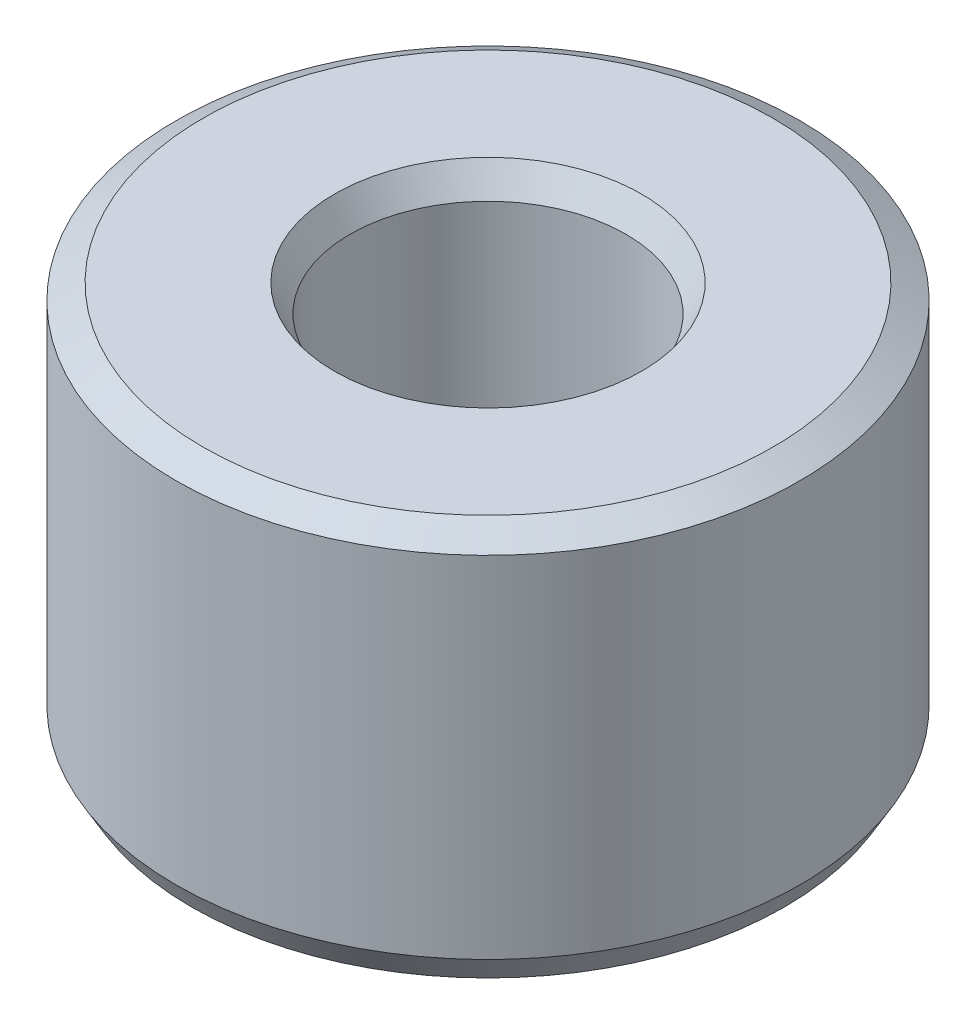
ISO-10303-21;
HEADER;
FILE_DESCRIPTION(('STEP AP214'),'2;1');
FILE_NAME('part.step','',(''),(''),'','','');
FILE_SCHEMA(('AUTOMOTIVE_DESIGN { 1 0 10303 214 1 1 1 1 }'));
ENDSEC;
DATA;
#1=APPLICATION_CONTEXT('core data for automotive mechanical design processes');
#2=APPLICATION_PROTOCOL_DEFINITION('international standard','automotive_design',2000,#1);
#3=PRODUCT_CONTEXT('',#1,'mechanical');
#4=PRODUCT('Part','Part','',(#3));
#5=PRODUCT_RELATED_PRODUCT_CATEGORY('part','',(#4));
#6=PRODUCT_DEFINITION_FORMATION('','',#4);
#7=PRODUCT_DEFINITION_CONTEXT('part definition',#1,'design');
#8=PRODUCT_DEFINITION('design','',#6,#7);
#9=PRODUCT_DEFINITION_SHAPE('','',#8);
#10=(LENGTH_UNIT() NAMED_UNIT(*) SI_UNIT(.MILLI.,.METRE.));
#11=(NAMED_UNIT(*) PLANE_ANGLE_UNIT() SI_UNIT($,.RADIAN.));
#12=(NAMED_UNIT(*) SI_UNIT($,.STERADIAN.) SOLID_ANGLE_UNIT());
#13=UNCERTAINTY_MEASURE_WITH_UNIT(LENGTH_MEASURE(1.E-05),#10,'distance_accuracy_value','');
#14=(GEOMETRIC_REPRESENTATION_CONTEXT(3) GLOBAL_UNCERTAINTY_ASSIGNED_CONTEXT((#13)) GLOBAL_UNIT_ASSIGNED_CONTEXT((#10,
#11,#12)) REPRESENTATION_CONTEXT('',''));
#15=CARTESIAN_POINT('',(0.,0.,0.));
#16=DIRECTION('',(0.,0.,1.));
#17=DIRECTION('',(1.,0.,0.));
#18=AXIS2_PLACEMENT_3D('',#15,#16,#17);
#19=CARTESIAN_POINT('',(0.,72.3742916803037,0.));
#20=DIRECTION('',(0.,-1.,0.));
#21=DIRECTION('',(0.,0.,-1.));
#22=AXIS2_PLACEMENT_3D('',#19,#20,#21);
#23=CYLINDRICAL_SURFACE('',#22,57.5);
#24=CARTESIAN_POINT('',(0.,4.98096415514812,0.));
#25=DIRECTION('',(0.,1.,0.));
#26=DIRECTION('',(0.,0.,1.));
#27=AXIS2_PLACEMENT_3D('',#24,#25,#26);
#28=CIRCLE('',#27,57.5);
#29=CARTESIAN_POINT('',(0.,4.98096415514812,57.5));
#30=VERTEX_POINT('',#29);
#31=EDGE_CURVE('E10',#30,#30,#28,.T.);
#32=ORIENTED_EDGE('',*,*,#31,.T.);
#33=EDGE_LOOP('',(#32));
#34=FACE_BOUND('',#33,.T.);
#35=CARTESIAN_POINT('',(0.,69.4985306845051,0.));
#36=DIRECTION('',(0.,1.,0.));
#37=DIRECTION('',(0.,0.,1.));
#38=AXIS2_PLACEMENT_3D('',#35,#36,#37);
#39=CIRCLE('',#38,57.5);
#40=CARTESIAN_POINT('',(0.,69.4985306845051,57.5));
#41=VERTEX_POINT('',#40);
#42=EDGE_CURVE('E50',#41,#41,#39,.F.);
#43=ORIENTED_EDGE('',*,*,#42,.T.);
#44=EDGE_LOOP('',(#43));
#45=FACE_BOUND('',#44,.T.);
#46=ADVANCED_FACE('F39',(#34,#45),#23,.T.);
#47=CARTESIAN_POINT('',(0.,72.3742916803037,0.));
#48=DIRECTION('',(0.,1.,0.));
#49=DIRECTION('',(0.,0.,1.));
#50=AXIS2_PLACEMENT_3D('',#47,#48,#49);
#51=PLANE('',#50);
#52=CARTESIAN_POINT('',(0.,72.3742916803037,0.));
#53=DIRECTION('',(0.,1.,0.));
#54=DIRECTION('',(0.,0.,1.));
#55=AXIS2_PLACEMENT_3D('',#52,#53,#54);
#56=CIRCLE('',#55,28.3063053164681);
#57=CARTESIAN_POINT('',(0.,72.3742916803037,28.3063053164681));
#58=VERTEX_POINT('',#57);
#59=EDGE_CURVE('E58',#58,#58,#56,.F.);
#60=ORIENTED_EDGE('',*,*,#59,.T.);
#61=EDGE_LOOP('',(#60));
#62=FACE_BOUND('',#61,.T.);
#63=CARTESIAN_POINT('',(0.,72.3742916803037,0.));
#64=DIRECTION('',(0.,1.,0.));
#65=DIRECTION('',(0.,0.,1.));
#66=AXIS2_PLACEMENT_3D('',#63,#64,#65);
#67=CIRCLE('',#66,52.5190358448518);
#68=CARTESIAN_POINT('',(0.,72.3742916803037,52.5190358448518));
#69=VERTEX_POINT('',#68);
#70=EDGE_CURVE('E61',#69,#69,#67,.T.);
#71=ORIENTED_EDGE('',*,*,#70,.T.);
#72=EDGE_LOOP('',(#71));
#73=FACE_BOUND('',#72,.T.);
#74=ADVANCED_FACE('F88',(#62,#73),#51,.T.);
#75=CARTESIAN_POINT('',(0.,0.,0.));
#76=DIRECTION('',(0.,1.,0.));
#77=DIRECTION('',(0.,0.,1.));
#78=AXIS2_PLACEMENT_3D('',#75,#76,#77);
#79=PLANE('',#78);
#80=CARTESIAN_POINT('',(0.,0.,0.));
#81=DIRECTION('',(0.,1.,0.));
#82=DIRECTION('',(0.,0.,1.));
#83=AXIS2_PLACEMENT_3D('',#80,#81,#82);
#84=CIRCLE('',#83,30.4115084758176);
#85=CARTESIAN_POINT('',(0.,0.,30.4115084758176));
#86=VERTEX_POINT('',#85);
#87=EDGE_CURVE('E51',#86,#86,#84,.T.);
#88=ORIENTED_EDGE('',*,*,#87,.T.);
#89=EDGE_LOOP('',(#88));
#90=FACE_BOUND('',#89,.T.);
#91=CARTESIAN_POINT('',(0.,0.,0.));
#92=DIRECTION('',(0.,1.,0.));
#93=DIRECTION('',(0.,0.,1.));
#94=AXIS2_PLACEMENT_3D('',#91,#92,#93);
#95=CIRCLE('',#94,54.6242390042013);
#96=CARTESIAN_POINT('',(0.,0.,54.6242390042013));
#97=VERTEX_POINT('',#96);
#98=EDGE_CURVE('E54',#97,#97,#95,.F.);
#99=ORIENTED_EDGE('',*,*,#98,.T.);
#100=EDGE_LOOP('',(#99));
#101=FACE_BOUND('',#100,.T.);
#102=ADVANCED_FACE('F83',(#90,#101),#79,.F.);
#103=CARTESIAN_POINT('',(0.,72.3742916803037,0.));
#104=DIRECTION('',(0.,-1.,0.));
#105=DIRECTION('',(0.,0.,-1.));
#106=AXIS2_PLACEMENT_3D('',#103,#104,#105);
#107=CYLINDRICAL_SURFACE('',#106,25.4305443206694);
#108=CARTESIAN_POINT('',(0.,67.3933275251556,0.));
#109=DIRECTION('',(0.,1.,0.));
#110=DIRECTION('',(0.,0.,1.));
#111=AXIS2_PLACEMENT_3D('',#108,#109,#110);
#112=CIRCLE('',#111,25.4305443206694);
#113=CARTESIAN_POINT('',(0.,67.3933275251555,25.4305443206694));
#114=VERTEX_POINT('',#113);
#115=EDGE_CURVE('E67',#114,#114,#112,.T.);
#116=ORIENTED_EDGE('',*,*,#115,.T.);
#117=EDGE_LOOP('',(#116));
#118=FACE_BOUND('',#117,.T.);
#119=CARTESIAN_POINT('',(0.,2.87576099579871,0.));
#120=DIRECTION('',(0.,1.,0.));
#121=DIRECTION('',(0.,0.,1.));
#122=AXIS2_PLACEMENT_3D('',#119,#120,#121);
#123=CIRCLE('',#122,25.4305443206694);
#124=CARTESIAN_POINT('',(0.,2.87576099579871,25.4305443206694));
#125=VERTEX_POINT('',#124);
#126=EDGE_CURVE('E69',#125,#125,#123,.F.);
#127=ORIENTED_EDGE('',*,*,#126,.T.);
#128=EDGE_LOOP('',(#127));
#129=FACE_BOUND('',#128,.T.);
#130=ADVANCED_FACE('F71',(#118,#129),#107,.F.);
#131=CARTESIAN_POINT('',(0.,67.3933275251556,0.));
#132=DIRECTION('',(0.,1.,0.));
#133=DIRECTION('',(0.,0.,1.));
#134=AXIS2_PLACEMENT_3D('',#131,#132,#133);
#135=CONICAL_SURFACE('',#134,25.4305443206694,0.523598775598303);
#136=CARTESIAN_POINT('',(0.,72.3742916803037,28.3063053164681));
#137=CARTESIAN_POINT('',(0.,72.3224066370209,28.2763494727619));
#138=CARTESIAN_POINT('',(0.,72.2705215937382,28.2463936290556));
#139=CARTESIAN_POINT('',(0.,72.1667515071725,28.1864819416432));
#140=CARTESIAN_POINT('',(0.,72.1148664638898,28.1565260979369));
#141=CARTESIAN_POINT('',(0.,72.0110963773242,28.0966144105245));
#142=CARTESIAN_POINT('',(0.,71.9592113340414,28.0666585668182));
#143=CARTESIAN_POINT('',(0.,71.8554412474758,28.0067468794057));
#144=CARTESIAN_POINT('',(0.,71.803556204193,27.9767910356995));
#145=CARTESIAN_POINT('',(0.,71.6997861176274,27.916879348287));
#146=CARTESIAN_POINT('',(0.,71.6479010743446,27.8869235045808));
#147=CARTESIAN_POINT('',(0.,71.544130987779,27.8270118171683));
#148=CARTESIAN_POINT('',(0.,71.4922459444962,27.7970559734621));
#149=CARTESIAN_POINT('',(0.,71.3884758579306,27.7371442860496));
#150=CARTESIAN_POINT('',(0.,71.3365908146479,27.7071884423434));
#151=CARTESIAN_POINT('',(0.,71.2328207280823,27.6472767549309));
#152=CARTESIAN_POINT('',(0.,71.1809356847995,27.6173209112247));
#153=CARTESIAN_POINT('',(0.,71.0771655982339,27.5574092238122));
#154=CARTESIAN_POINT('',(0.,71.0252805549511,27.527453380106));
#155=CARTESIAN_POINT('',(0.,70.9215104683855,27.4675416926935));
#156=CARTESIAN_POINT('',(0.,70.8696254251027,27.4375858489873));
#157=CARTESIAN_POINT('',(0.,70.7658553385371,27.3776741615748));
#158=CARTESIAN_POINT('',(0.,70.7139702952543,27.3477183178686));
#159=CARTESIAN_POINT('',(0.,70.6102002086887,27.2878066304561));
#160=CARTESIAN_POINT('',(0.,70.558315165406,27.2578507867498));
#161=CARTESIAN_POINT('',(0.,70.4545450788404,27.1979390993374));
#162=CARTESIAN_POINT('',(0.,70.4026600355576,27.1679832556311));
#163=CARTESIAN_POINT('',(0.,70.298889948992,27.1080715682187));
#164=CARTESIAN_POINT('',(0.,70.2470049057092,27.0781157245124));
#165=CARTESIAN_POINT('',(0.,70.1432348191436,27.0182040370999));
#166=CARTESIAN_POINT('',(0.,70.0913497758608,26.9882481933937));
#167=CARTESIAN_POINT('',(0.,69.9875796892952,26.9283365059812));
#168=CARTESIAN_POINT('',(0.,69.9356946460124,26.898380662275));
#169=CARTESIAN_POINT('',(0.,69.8319245594468,26.8384689748625));
#170=CARTESIAN_POINT('',(0.,69.7800395161641,26.8085131311563));
#171=CARTESIAN_POINT('',(0.,69.6762694295985,26.7486014437438));
#172=CARTESIAN_POINT('',(0.,69.6243843863157,26.7186456000376));
#173=CARTESIAN_POINT('',(0.,69.5206142997501,26.6587339126251));
#174=CARTESIAN_POINT('',(0.,69.4687292564673,26.6287780689189));
#175=CARTESIAN_POINT('',(0.,69.3649591699017,26.5688663815064));
#176=CARTESIAN_POINT('',(0.,69.3130741266189,26.5389105378002));
#177=CARTESIAN_POINT('',(0.,69.2093040400533,26.4789988503877));
#178=CARTESIAN_POINT('',(0.,69.1574189967705,26.4490430066815));
#179=CARTESIAN_POINT('',(0.,69.0536489102049,26.389131319269));
#180=CARTESIAN_POINT('',(0.,69.0017638669221,26.3591754755627));
#181=CARTESIAN_POINT('',(0.,68.8979937803566,26.2992637881503));
#182=CARTESIAN_POINT('',(0.,68.8461087370738,26.269307944444));
#183=CARTESIAN_POINT('',(0.,68.7423386505082,26.2093962570316));
#184=CARTESIAN_POINT('',(0.,68.6904536072254,26.1794404133253));
#185=CARTESIAN_POINT('',(0.,68.5866835206598,26.1195287259129));
#186=CARTESIAN_POINT('',(0.,68.534798477377,26.0895728822066));
#187=CARTESIAN_POINT('',(0.,68.4310283908114,26.0296611947941));
#188=CARTESIAN_POINT('',(0.,68.3791433475286,25.9997053510879));
#189=CARTESIAN_POINT('',(0.,68.275373260963,25.9397936636754));
#190=CARTESIAN_POINT('',(0.,68.2234882176802,25.9098378199692));
#191=CARTESIAN_POINT('',(0.,68.1197181311147,25.8499261325567));
#192=CARTESIAN_POINT('',(0.,68.0678330878319,25.8199702888505));
#193=CARTESIAN_POINT('',(0.,67.9640630012663,25.760058601438));
#194=CARTESIAN_POINT('',(0.,67.9121779579835,25.7301027577318));
#195=CARTESIAN_POINT('',(0.,67.8084078714179,25.6701910703193));
#196=CARTESIAN_POINT('',(0.,67.7565228281351,25.6402352266131));
#197=CARTESIAN_POINT('',(0.,67.6527527415695,25.5803235392006));
#198=CARTESIAN_POINT('',(0.,67.6008676982867,25.5503676954944));
#199=CARTESIAN_POINT('',(0.,67.4970976117211,25.4904560080819));
#200=CARTESIAN_POINT('',(0.,67.4452125684384,25.4605001643757));
#201=CARTESIAN_POINT('',(0.,67.3933275251556,25.4305443206694));
#202=B_SPLINE_CURVE_WITH_KNOTS('',3,(#136,#137,#138,#139,#140,#141,#142,#143,#144,#145,#146,
#147,#148,#149,#150,#151,#152,#153,#154,#155,#156,#157,#158,#159,#160,#161,#162,#163,#164,#165,
#166,#167,#168,#169,#170,#171,#172,#173,#174,#175,#176,#177,#178,#179,#180,#181,#182,#183,#184,
#185,#186,#187,#188,#189,#190,#191,#192,#193,#194,#195,#196,#197,#198,#199,#200,#201),
.UNSPECIFIED.,.F.,.F.,(4,2,2,2,2,2,2,2,2,2,2,2,2,2,2,2,2,2,2,2,2,2,2,2,2,2,2,2,2,2,2,2,4),(0.,
0.17973506223741,0.359470124474835,0.539205186712245,0.718940248949667,0.89867531118708,
1.0784103734245,1.25814543566191,1.43788049789933,1.61761556013676,1.79735062237417,
1.97708568461159,2.156820746849,2.33655580908643,2.51629087132384,2.69602593356126,
2.87576099579868,3.05549605803609,3.23523112027352,3.41496618251093,3.59470124474835,
3.77443630698576,3.95417136922318,4.1339064314606,4.31364149369802,4.49337655593544,
4.67311161817285,4.85284668041028,5.03258174264769,5.21231680488511,5.39205186712252,
5.57178692935994,5.75152199159735),.UNSPECIFIED.);
#203=EDGE_CURVE('BSEAM77',#58,#114,#202,.T.);
#204=ORIENTED_EDGE('',*,*,#59,.F.);
#205=ORIENTED_EDGE('',*,*,#115,.F.);
#206=ORIENTED_EDGE('',*,*,#203,.T.);
#207=ORIENTED_EDGE('',*,*,#203,.F.);
#208=EDGE_LOOP('',(#204,#206,#205,#207));
#209=FACE_BOUND('',#208,.T.);
#210=ADVANCED_FACE('F77',(#209),#135,.F.);
#211=CARTESIAN_POINT('',(0.,0.,0.));
#212=DIRECTION('',(0.,-1.,0.));
#213=DIRECTION('',(0.,0.,-1.));
#214=AXIS2_PLACEMENT_3D('',#211,#212,#213);
#215=CONICAL_SURFACE('',#214,30.4115084758176,1.04719755119659);
#216=ORIENTED_EDGE('',*,*,#126,.F.);
#217=EDGE_LOOP('',(#216));
#218=FACE_BOUND('',#217,.T.);
#219=ORIENTED_EDGE('',*,*,#87,.F.);
#220=EDGE_LOOP('',(#219));
#221=FACE_BOUND('',#220,.T.);
#222=ADVANCED_FACE('F73',(#218,#221),#215,.F.);
#223=CARTESIAN_POINT('',(0.,4.98096415514812,0.));
#224=DIRECTION('',(0.,1.,0.));
#225=DIRECTION('',(0.,0.,1.));
#226=AXIS2_PLACEMENT_3D('',#223,#224,#225);
#227=CONICAL_SURFACE('',#226,57.5,0.523598775598303);
#228=ORIENTED_EDGE('',*,*,#98,.F.);
#229=EDGE_LOOP('',(#228));
#230=FACE_BOUND('',#229,.T.);
#231=ORIENTED_EDGE('',*,*,#31,.F.);
#232=EDGE_LOOP('',(#231));
#233=FACE_BOUND('',#232,.T.);
#234=ADVANCED_FACE('F76',(#230,#233),#227,.T.);
#235=CARTESIAN_POINT('',(0.,72.3742916803037,0.));
#236=DIRECTION('',(0.,-1.,0.));
#237=DIRECTION('',(0.,0.,-1.));
#238=AXIS2_PLACEMENT_3D('',#235,#236,#237);
#239=CONICAL_SURFACE('',#238,52.5190358448518,1.04719755119659);
#240=ORIENTED_EDGE('',*,*,#42,.F.);
#241=EDGE_LOOP('',(#240));
#242=FACE_BOUND('',#241,.T.);
#243=ORIENTED_EDGE('',*,*,#70,.F.);
#244=EDGE_LOOP('',(#243));
#245=FACE_BOUND('',#244,.T.);
#246=ADVANCED_FACE('F45',(#242,#245),#239,.T.);
#247=CLOSED_SHELL('',(#46,#74,#102,#130,#210,#222,#234,#246));
#248=MANIFOLD_SOLID_BREP('B2',#247);
#249=ADVANCED_BREP_SHAPE_REPRESENTATION('',(#18,#248),#14);
#250=SHAPE_DEFINITION_REPRESENTATION(#9,#249);
ENDSEC;
END-ISO-10303-21;
